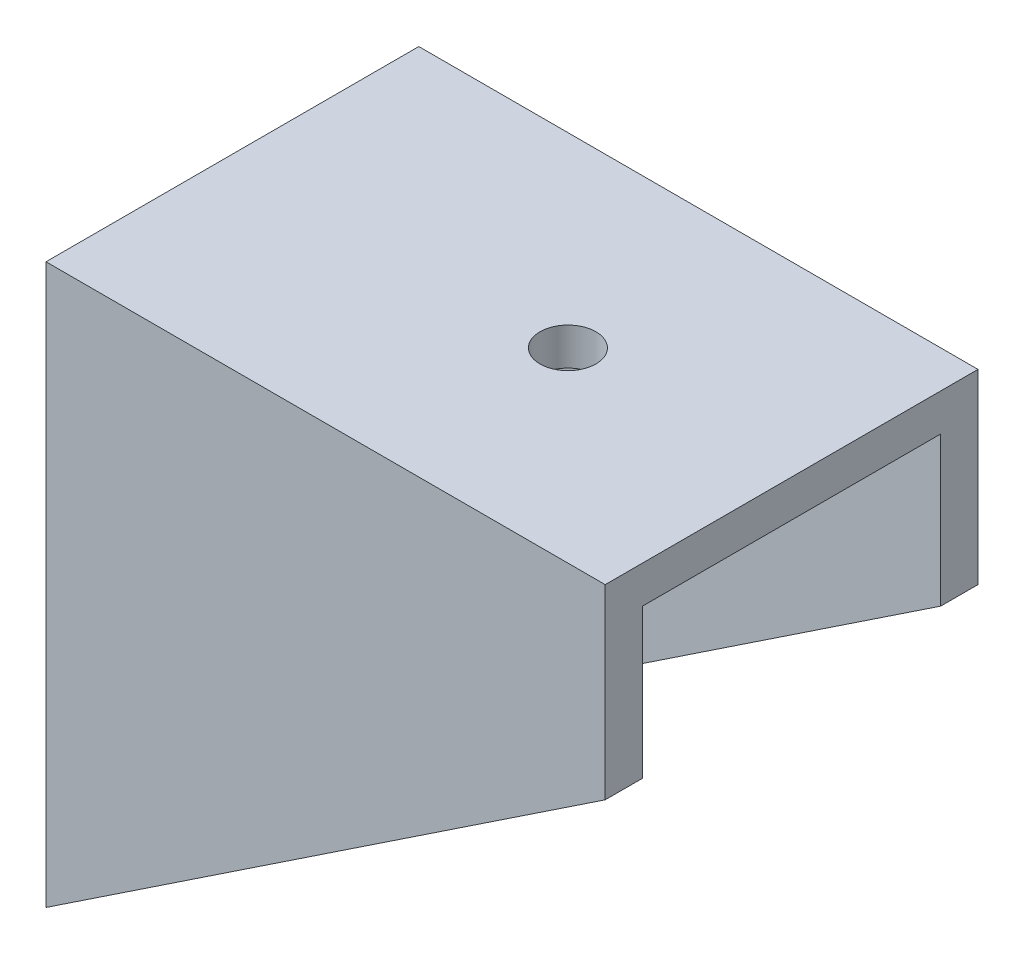
ISO-10303-21;
HEADER;
FILE_DESCRIPTION(('STEP AP214'),'2;1');
FILE_NAME('part.step','',(''),(''),'','','');
FILE_SCHEMA(('AUTOMOTIVE_DESIGN { 1 0 10303 214 1 1 1 1 }'));
ENDSEC;
DATA;
#1=APPLICATION_CONTEXT('core data for automotive mechanical design processes');
#2=APPLICATION_PROTOCOL_DEFINITION('international standard','automotive_design',2000,#1);
#3=PRODUCT_CONTEXT('',#1,'mechanical');
#4=PRODUCT('Part','Part','',(#3));
#5=PRODUCT_RELATED_PRODUCT_CATEGORY('part','',(#4));
#6=PRODUCT_DEFINITION_FORMATION('','',#4);
#7=PRODUCT_DEFINITION_CONTEXT('part definition',#1,'design');
#8=PRODUCT_DEFINITION('design','',#6,#7);
#9=PRODUCT_DEFINITION_SHAPE('','',#8);
#10=(LENGTH_UNIT() NAMED_UNIT(*) SI_UNIT(.MILLI.,.METRE.));
#11=(NAMED_UNIT(*) PLANE_ANGLE_UNIT() SI_UNIT($,.RADIAN.));
#12=(NAMED_UNIT(*) SI_UNIT($,.STERADIAN.) SOLID_ANGLE_UNIT());
#13=UNCERTAINTY_MEASURE_WITH_UNIT(LENGTH_MEASURE(1.E-05),#10,'distance_accuracy_value','');
#14=(GEOMETRIC_REPRESENTATION_CONTEXT(3) GLOBAL_UNCERTAINTY_ASSIGNED_CONTEXT((#13)) GLOBAL_UNIT_ASSIGNED_CONTEXT((#10,
#11,#12)) REPRESENTATION_CONTEXT('',''));
#15=CARTESIAN_POINT('',(0.,0.,0.));
#16=DIRECTION('',(0.,0.,1.));
#17=DIRECTION('',(1.,0.,0.));
#18=AXIS2_PLACEMENT_3D('',#15,#16,#17);
#19=CARTESIAN_POINT('',(30.,30.,-18.));
#20=DIRECTION('',(0.,0.,-1.));
#21=DIRECTION('',(0.,1.,0.));
#22=AXIS2_PLACEMENT_3D('',#19,#20,#21);
#23=PLANE('',#22);
#24=DIRECTION('',(0.,-1.,0.));
#25=VECTOR('',#24,1.);
#26=CARTESIAN_POINT('',(0.,30.,-18.));
#27=LINE('',#26,#25);
#28=CARTESIAN_POINT('',(0.,28.,-18.));
#29=VERTEX_POINT('',#28);
#30=CARTESIAN_POINT('',(0.,0.,-18.));
#31=VERTEX_POINT('',#30);
#32=EDGE_CURVE('E154',#29,#31,#27,.T.);
#33=ORIENTED_EDGE('',*,*,#32,.T.);
#34=DIRECTION('',(0.832050294337844,0.554700196225229,0.));
#35=VECTOR('',#34,1.);
#36=CARTESIAN_POINT('',(34.6153846153846,23.0769230769231,-18.));
#37=LINE('',#36,#35);
#38=CARTESIAN_POINT('',(30.,20.,-18.));
#39=VERTEX_POINT('',#38);
#40=EDGE_CURVE('E158',#31,#39,#37,.T.);
#41=ORIENTED_EDGE('',*,*,#40,.T.);
#42=DIRECTION('',(0.,-1.,0.));
#43=VECTOR('',#42,1.);
#44=CARTESIAN_POINT('',(30.,30.,-18.));
#45=LINE('',#44,#43);
#46=CARTESIAN_POINT('',(30.,28.,-18.));
#47=VERTEX_POINT('',#46);
#48=EDGE_CURVE('E131',#47,#39,#45,.T.);
#49=ORIENTED_EDGE('',*,*,#48,.F.);
#50=DIRECTION('',(-1.,0.,0.));
#51=VECTOR('',#50,1.);
#52=CARTESIAN_POINT('',(30.,28.,-18.));
#53=LINE('',#52,#51);
#54=EDGE_CURVE('E153',#47,#29,#53,.T.);
#55=ORIENTED_EDGE('',*,*,#54,.T.);
#56=EDGE_LOOP('',(#33,#41,#49,#55));
#57=FACE_BOUND('',#56,.T.);
#58=ADVANCED_FACE('F38',(#57),#23,.F.);
#59=CARTESIAN_POINT('',(30.,30.,-20.));
#60=DIRECTION('',(0.,0.,-1.));
#61=DIRECTION('',(0.,1.,0.));
#62=AXIS2_PLACEMENT_3D('',#59,#60,#61);
#63=PLANE('',#62);
#64=DIRECTION('',(-0.832050294337844,-0.554700196225229,0.));
#65=VECTOR('',#64,1.);
#66=CARTESIAN_POINT('',(0.,0.,-20.));
#67=LINE('',#66,#65);
#68=CARTESIAN_POINT('',(30.,20.,-20.));
#69=VERTEX_POINT('',#68);
#70=CARTESIAN_POINT('',(0.,0.,-20.));
#71=VERTEX_POINT('',#70);
#72=EDGE_CURVE('E113',#69,#71,#67,.T.);
#73=ORIENTED_EDGE('',*,*,#72,.T.);
#74=DIRECTION('',(0.,-1.,0.));
#75=VECTOR('',#74,1.);
#76=CARTESIAN_POINT('',(0.,30.,-20.));
#77=LINE('',#76,#75);
#78=CARTESIAN_POINT('',(0.,30.,-20.));
#79=VERTEX_POINT('',#78);
#80=EDGE_CURVE('E161',#79,#71,#77,.T.);
#81=ORIENTED_EDGE('',*,*,#80,.F.);
#82=DIRECTION('',(-1.,0.,0.));
#83=VECTOR('',#82,1.);
#84=CARTESIAN_POINT('',(30.,30.,-20.));
#85=LINE('',#84,#83);
#86=CARTESIAN_POINT('',(30.,30.,-20.));
#87=VERTEX_POINT('',#86);
#88=EDGE_CURVE('E11',#87,#79,#85,.T.);
#89=ORIENTED_EDGE('',*,*,#88,.F.);
#90=DIRECTION('',(0.,-1.,0.));
#91=VECTOR('',#90,1.);
#92=CARTESIAN_POINT('',(30.,30.,-20.));
#93=LINE('',#92,#91);
#94=EDGE_CURVE('E128',#87,#69,#93,.T.);
#95=ORIENTED_EDGE('',*,*,#94,.T.);
#96=EDGE_LOOP('',(#73,#81,#89,#95));
#97=FACE_BOUND('',#96,.T.);
#98=ADVANCED_FACE('F135',(#97),#63,.T.);
#99=CARTESIAN_POINT('',(30.,30.,0.));
#100=DIRECTION('',(0.,1.,0.));
#101=DIRECTION('',(0.,0.,1.));
#102=AXIS2_PLACEMENT_3D('',#99,#100,#101);
#103=PLANE('',#102);
#104=CARTESIAN_POINT('',(18.,30.,-10.));
#105=DIRECTION('',(0.,1.,0.));
#106=DIRECTION('',(0.,0.,1.));
#107=AXIS2_PLACEMENT_3D('',#104,#105,#106);
#108=CIRCLE('',#107,1.5);
#109=CARTESIAN_POINT('',(18.,30.,-8.5));
#110=VERTEX_POINT('',#109);
#111=EDGE_CURVE('E208',#110,#110,#108,.T.);
#112=ORIENTED_EDGE('',*,*,#111,.F.);
#113=EDGE_LOOP('',(#112));
#114=FACE_BOUND('',#113,.T.);
#115=DIRECTION('',(0.,0.,-1.));
#116=VECTOR('',#115,1.);
#117=CARTESIAN_POINT('',(0.,30.,0.));
#118=LINE('',#117,#116);
#119=CARTESIAN_POINT('',(0.,30.,0.));
#120=VERTEX_POINT('',#119);
#121=EDGE_CURVE('E164',#120,#79,#118,.T.);
#122=ORIENTED_EDGE('',*,*,#121,.F.);
#123=DIRECTION('',(-1.,0.,0.));
#124=VECTOR('',#123,1.);
#125=CARTESIAN_POINT('',(30.,30.,0.));
#126=LINE('',#125,#124);
#127=CARTESIAN_POINT('',(30.,30.,0.));
#128=VERTEX_POINT('',#127);
#129=EDGE_CURVE('E48',#128,#120,#126,.T.);
#130=ORIENTED_EDGE('',*,*,#129,.F.);
#131=DIRECTION('',(0.,0.,-1.));
#132=VECTOR('',#131,1.);
#133=CARTESIAN_POINT('',(30.,30.,0.));
#134=LINE('',#133,#132);
#135=EDGE_CURVE('E137',#128,#87,#134,.T.);
#136=ORIENTED_EDGE('',*,*,#135,.T.);
#137=ORIENTED_EDGE('',*,*,#88,.T.);
#138=EDGE_LOOP('',(#122,#130,#136,#137));
#139=FACE_BOUND('',#138,.T.);
#140=ADVANCED_FACE('F193',(#114,#139),#103,.T.);
#141=CARTESIAN_POINT('',(30.,0.,0.));
#142=DIRECTION('',(0.,0.,1.));
#143=DIRECTION('',(1.,0.,0.));
#144=AXIS2_PLACEMENT_3D('',#141,#142,#143);
#145=PLANE('',#144);
#146=DIRECTION('',(-0.832050294337844,-0.554700196225229,0.));
#147=VECTOR('',#146,1.);
#148=CARTESIAN_POINT('',(0.,0.,0.));
#149=LINE('',#148,#147);
#150=CARTESIAN_POINT('',(30.,20.,0.));
#151=VERTEX_POINT('',#150);
#152=CARTESIAN_POINT('',(0.,0.,0.));
#153=VERTEX_POINT('',#152);
#154=EDGE_CURVE('E123',#151,#153,#149,.T.);
#155=ORIENTED_EDGE('',*,*,#154,.F.);
#156=DIRECTION('',(0.,1.,0.));
#157=VECTOR('',#156,1.);
#158=CARTESIAN_POINT('',(30.,0.,0.));
#159=LINE('',#158,#157);
#160=EDGE_CURVE('E141',#151,#128,#159,.T.);
#161=ORIENTED_EDGE('',*,*,#160,.T.);
#162=ORIENTED_EDGE('',*,*,#129,.T.);
#163=DIRECTION('',(0.,1.,0.));
#164=VECTOR('',#163,1.);
#165=CARTESIAN_POINT('',(0.,0.,0.));
#166=LINE('',#165,#164);
#167=EDGE_CURVE('E168',#153,#120,#166,.T.);
#168=ORIENTED_EDGE('',*,*,#167,.F.);
#169=EDGE_LOOP('',(#155,#161,#162,#168));
#170=FACE_BOUND('',#169,.T.);
#171=ADVANCED_FACE('F191',(#170),#145,.T.);
#172=CARTESIAN_POINT('',(30.,0.,-2.));
#173=DIRECTION('',(0.,0.,1.));
#174=DIRECTION('',(1.,0.,0.));
#175=AXIS2_PLACEMENT_3D('',#172,#173,#174);
#176=PLANE('',#175);
#177=DIRECTION('',(0.,1.,0.));
#178=VECTOR('',#177,1.);
#179=CARTESIAN_POINT('',(30.,0.,-2.));
#180=LINE('',#179,#178);
#181=CARTESIAN_POINT('',(30.,20.,-2.00000000000001));
#182=VERTEX_POINT('',#181);
#183=CARTESIAN_POINT('',(30.,28.,-2.));
#184=VERTEX_POINT('',#183);
#185=EDGE_CURVE('E148',#182,#184,#180,.T.);
#186=ORIENTED_EDGE('',*,*,#185,.F.);
#187=DIRECTION('',(-0.832050294337844,-0.554700196225229,0.));
#188=VECTOR('',#187,1.);
#189=CARTESIAN_POINT('',(20.7692307692308,13.8461538461538,-2.));
#190=LINE('',#189,#188);
#191=CARTESIAN_POINT('',(0.,0.,-2.00000000000001));
#192=VERTEX_POINT('',#191);
#193=EDGE_CURVE('E133',#182,#192,#190,.T.);
#194=ORIENTED_EDGE('',*,*,#193,.T.);
#195=DIRECTION('',(0.,1.,0.));
#196=VECTOR('',#195,1.);
#197=CARTESIAN_POINT('',(0.,0.,-2.));
#198=LINE('',#197,#196);
#199=CARTESIAN_POINT('',(0.,28.,-2.));
#200=VERTEX_POINT('',#199);
#201=EDGE_CURVE('E79',#192,#200,#198,.T.);
#202=ORIENTED_EDGE('',*,*,#201,.T.);
#203=DIRECTION('',(-1.,0.,0.));
#204=VECTOR('',#203,1.);
#205=CARTESIAN_POINT('',(30.,28.,-2.));
#206=LINE('',#205,#204);
#207=EDGE_CURVE('E182',#184,#200,#206,.T.);
#208=ORIENTED_EDGE('',*,*,#207,.F.);
#209=EDGE_LOOP('',(#186,#194,#202,#208));
#210=FACE_BOUND('',#209,.T.);
#211=ADVANCED_FACE('F201',(#210),#176,.F.);
#212=CARTESIAN_POINT('',(30.,28.,0.));
#213=DIRECTION('',(0.,1.,0.));
#214=DIRECTION('',(0.,0.,1.));
#215=AXIS2_PLACEMENT_3D('',#212,#213,#214);
#216=PLANE('',#215);
#217=CARTESIAN_POINT('',(18.,28.,-10.));
#218=DIRECTION('',(0.,1.,0.));
#219=DIRECTION('',(0.,0.,1.));
#220=AXIS2_PLACEMENT_3D('',#217,#218,#219);
#221=CIRCLE('',#220,1.5);
#222=CARTESIAN_POINT('',(18.,28.,-8.5));
#223=VERTEX_POINT('',#222);
#224=EDGE_CURVE('E41',#223,#223,#221,.T.);
#225=ORIENTED_EDGE('',*,*,#224,.T.);
#226=EDGE_LOOP('',(#225));
#227=FACE_BOUND('',#226,.T.);
#228=DIRECTION('',(0.,0.,-1.));
#229=VECTOR('',#228,1.);
#230=CARTESIAN_POINT('',(0.,28.,0.));
#231=LINE('',#230,#229);
#232=EDGE_CURVE('E85',#200,#29,#231,.T.);
#233=ORIENTED_EDGE('',*,*,#232,.T.);
#234=ORIENTED_EDGE('',*,*,#54,.F.);
#235=DIRECTION('',(0.,0.,-1.));
#236=VECTOR('',#235,1.);
#237=CARTESIAN_POINT('',(30.,28.,0.));
#238=LINE('',#237,#236);
#239=EDGE_CURVE('E56',#184,#47,#238,.T.);
#240=ORIENTED_EDGE('',*,*,#239,.F.);
#241=ORIENTED_EDGE('',*,*,#207,.T.);
#242=EDGE_LOOP('',(#233,#234,#240,#241));
#243=FACE_BOUND('',#242,.T.);
#244=ADVANCED_FACE('F217',(#227,#243),#216,.F.);
#245=CARTESIAN_POINT('',(30.,0.,0.));
#246=DIRECTION('',(-1.,0.,0.));
#247=DIRECTION('',(0.,0.,1.));
#248=AXIS2_PLACEMENT_3D('',#245,#246,#247);
#249=PLANE('',#248);
#250=ORIENTED_EDGE('',*,*,#160,.F.);
#251=DIRECTION('',(0.,0.,1.));
#252=VECTOR('',#251,1.);
#253=CARTESIAN_POINT('',(30.,20.,-20.));
#254=LINE('',#253,#252);
#255=EDGE_CURVE('E122',#182,#151,#254,.T.);
#256=ORIENTED_EDGE('',*,*,#255,.F.);
#257=ORIENTED_EDGE('',*,*,#185,.T.);
#258=ORIENTED_EDGE('',*,*,#239,.T.);
#259=ORIENTED_EDGE('',*,*,#48,.T.);
#260=EDGE_CURVE('E116',#69,#39,#254,.T.);
#261=ORIENTED_EDGE('',*,*,#260,.F.);
#262=ORIENTED_EDGE('',*,*,#94,.F.);
#263=ORIENTED_EDGE('',*,*,#135,.F.);
#264=EDGE_LOOP('',(#250,#256,#257,#258,#259,#261,#262,#263));
#265=FACE_BOUND('',#264,.T.);
#266=ADVANCED_FACE('F126',(#265),#249,.F.);
#267=CARTESIAN_POINT('',(0.,0.,0.));
#268=DIRECTION('',(-1.,0.,0.));
#269=DIRECTION('',(0.,0.,1.));
#270=AXIS2_PLACEMENT_3D('',#267,#268,#269);
#271=PLANE('',#270);
#272=ORIENTED_EDGE('',*,*,#32,.F.);
#273=ORIENTED_EDGE('',*,*,#232,.F.);
#274=ORIENTED_EDGE('',*,*,#201,.F.);
#275=DIRECTION('',(0.,0.,1.));
#276=VECTOR('',#275,1.);
#277=CARTESIAN_POINT('',(0.,0.,-2.));
#278=LINE('',#277,#276);
#279=EDGE_CURVE('E172',#192,#153,#278,.T.);
#280=ORIENTED_EDGE('',*,*,#279,.T.);
#281=ORIENTED_EDGE('',*,*,#167,.T.);
#282=ORIENTED_EDGE('',*,*,#121,.T.);
#283=ORIENTED_EDGE('',*,*,#80,.T.);
#284=DIRECTION('',(0.,0.,1.));
#285=VECTOR('',#284,1.);
#286=CARTESIAN_POINT('',(0.,0.,-20.));
#287=LINE('',#286,#285);
#288=EDGE_CURVE('E119',#71,#31,#287,.T.);
#289=ORIENTED_EDGE('',*,*,#288,.T.);
#290=EDGE_LOOP('',(#272,#273,#274,#280,#281,#282,#283,#289));
#291=FACE_BOUND('',#290,.T.);
#292=ADVANCED_FACE('F196',(#291),#271,.T.);
#293=CARTESIAN_POINT('',(0.,0.,-20.));
#294=DIRECTION('',(-0.554700196225229,0.832050294337844,0.));
#295=DIRECTION('',(-0.832050294337844,-0.554700196225229,0.));
#296=AXIS2_PLACEMENT_3D('',#293,#294,#295);
#297=PLANE('',#296);
#298=ORIENTED_EDGE('',*,*,#288,.F.);
#299=ORIENTED_EDGE('',*,*,#72,.F.);
#300=ORIENTED_EDGE('',*,*,#260,.T.);
#301=ORIENTED_EDGE('',*,*,#40,.F.);
#302=EDGE_LOOP('',(#298,#299,#300,#301));
#303=FACE_BOUND('',#302,.T.);
#304=ADVANCED_FACE('F115',(#303),#297,.F.);
#305=ORIENTED_EDGE('',*,*,#255,.T.);
#306=ORIENTED_EDGE('',*,*,#154,.T.);
#307=ORIENTED_EDGE('',*,*,#279,.F.);
#308=ORIENTED_EDGE('',*,*,#193,.F.);
#309=EDGE_LOOP('',(#305,#306,#307,#308));
#310=FACE_BOUND('',#309,.T.);
#311=ADVANCED_FACE('F198',(#310),#297,.F.);
#312=CARTESIAN_POINT('',(18.,0.,-10.));
#313=DIRECTION('',(0.,1.,0.));
#314=DIRECTION('',(0.,0.,1.));
#315=AXIS2_PLACEMENT_3D('',#312,#313,#314);
#316=CYLINDRICAL_SURFACE('',#315,1.5);
#317=ORIENTED_EDGE('',*,*,#111,.T.);
#318=EDGE_LOOP('',(#317));
#319=FACE_BOUND('',#318,.T.);
#320=ORIENTED_EDGE('',*,*,#224,.F.);
#321=EDGE_LOOP('',(#320));
#322=FACE_BOUND('',#321,.T.);
#323=ADVANCED_FACE('F219',(#319,#322),#316,.F.);
#324=CLOSED_SHELL('',(#58,#98,#140,#171,#211,#244,#266,#292,#304,#311,#323));
#325=MANIFOLD_SOLID_BREP('B2',#324);
#326=ADVANCED_BREP_SHAPE_REPRESENTATION('',(#18,#325),#14);
#327=SHAPE_DEFINITION_REPRESENTATION(#9,#326);
ENDSEC;
END-ISO-10303-21;
